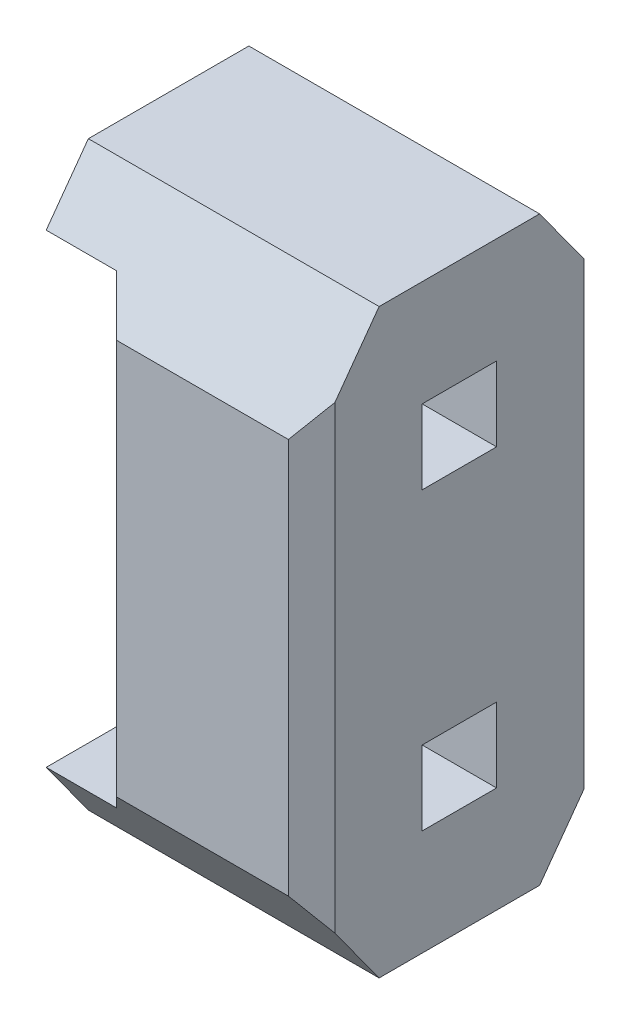
ISO-10303-21;
HEADER;
FILE_DESCRIPTION(('STEP AP214'),'2;1');
FILE_NAME('part.step','',(''),(''),'','','');
FILE_SCHEMA(('AUTOMOTIVE_DESIGN { 1 0 10303 214 1 1 1 1 }'));
ENDSEC;
DATA;
#1=APPLICATION_CONTEXT('core data for automotive mechanical design processes');
#2=APPLICATION_PROTOCOL_DEFINITION('international standard','automotive_design',2000,#1);
#3=PRODUCT_CONTEXT('',#1,'mechanical');
#4=PRODUCT('Part','Part','',(#3));
#5=PRODUCT_RELATED_PRODUCT_CATEGORY('part','',(#4));
#6=PRODUCT_DEFINITION_FORMATION('','',#4);
#7=PRODUCT_DEFINITION_CONTEXT('part definition',#1,'design');
#8=PRODUCT_DEFINITION('design','',#6,#7);
#9=PRODUCT_DEFINITION_SHAPE('','',#8);
#10=(LENGTH_UNIT() NAMED_UNIT(*) SI_UNIT(.MILLI.,.METRE.));
#11=(NAMED_UNIT(*) PLANE_ANGLE_UNIT() SI_UNIT($,.RADIAN.));
#12=(NAMED_UNIT(*) SI_UNIT($,.STERADIAN.) SOLID_ANGLE_UNIT());
#13=UNCERTAINTY_MEASURE_WITH_UNIT(LENGTH_MEASURE(1.E-05),#10,'distance_accuracy_value','');
#14=(GEOMETRIC_REPRESENTATION_CONTEXT(3) GLOBAL_UNCERTAINTY_ASSIGNED_CONTEXT((#13)) GLOBAL_UNIT_ASSIGNED_CONTEXT((#10,
#11,#12)) REPRESENTATION_CONTEXT('',''));
#15=CARTESIAN_POINT('',(0.,0.,0.));
#16=DIRECTION('',(0.,0.,1.));
#17=DIRECTION('',(1.,0.,0.));
#18=AXIS2_PLACEMENT_3D('',#15,#16,#17);
#19=CARTESIAN_POINT('',(1.25,4.6,-30.77));
#20=DIRECTION('',(0.,0.586967571460905,0.809610443394407));
#21=DIRECTION('',(0.,-0.809610443394407,0.586967571460905));
#22=AXIS2_PLACEMENT_3D('',#19,#20,#21);
#23=PLANE('',#22);
#24=DIRECTION('',(1.,0.,0.));
#25=VECTOR('',#24,1.);
#26=CARTESIAN_POINT('',(1.25,4.5,-30.6975));
#27=LINE('',#26,#25);
#28=CARTESIAN_POINT('',(0.,4.5,-30.6975));
#29=VERTEX_POINT('',#28);
#30=CARTESIAN_POINT('',(0.602500000000325,4.5,-30.6975000000001));
#31=VERTEX_POINT('',#30);
#32=EDGE_CURVE('E199',#29,#31,#27,.T.);
#33=ORIENTED_EDGE('',*,*,#32,.T.);
#34=DIRECTION('',(0.506207656348697,-0.698217457033984,0.506207656349602));
#35=VECTOR('',#34,1.);
#36=CARTESIAN_POINT('',(0.6025000000002,4.5,-30.6975));
#37=LINE('',#36,#35);
#38=CARTESIAN_POINT('',(0.819999999999671,4.2,-30.4799999999999));
#39=VERTEX_POINT('',#38);
#40=EDGE_CURVE('E197',#31,#39,#37,.T.);
#41=ORIENTED_EDGE('',*,*,#40,.T.);
#42=DIRECTION('',(1.,0.,0.));
#43=VECTOR('',#42,1.);
#44=CARTESIAN_POINT('',(1.25,4.19999999999999,-30.48));
#45=LINE('',#44,#43);
#46=CARTESIAN_POINT('',(2.30000000000012,4.2,-30.4799999999999));
#47=VERTEX_POINT('',#46);
#48=EDGE_CURVE('E20',#39,#47,#45,.T.);
#49=ORIENTED_EDGE('',*,*,#48,.T.);
#50=DIRECTION('',(0.506207656348961,0.698217457033859,-0.50620765634951));
#51=VECTOR('',#50,1.);
#52=CARTESIAN_POINT('',(2.3,4.19999999999999,-30.48));
#53=LINE('',#52,#51);
#54=CARTESIAN_POINT('',(2.49999999999988,4.47586206896591,-30.6800000000002));
#55=VERTEX_POINT('',#54);
#56=EDGE_CURVE('E181',#47,#55,#53,.T.);
#57=ORIENTED_EDGE('',*,*,#56,.T.);
#58=DIRECTION('',(0.,-0.809610443394407,0.586967571460905));
#59=VECTOR('',#58,1.);
#60=CARTESIAN_POINT('',(2.5,4.6,-30.77));
#61=LINE('',#60,#59);
#62=CARTESIAN_POINT('',(2.5,5.00000000000001,-31.06));
#63=VERTEX_POINT('',#62);
#64=EDGE_CURVE('E188',#55,#63,#61,.F.);
#65=ORIENTED_EDGE('',*,*,#64,.T.);
#66=DIRECTION('',(1.,0.,0.));
#67=VECTOR('',#66,1.);
#68=CARTESIAN_POINT('',(1.25,5.,-31.06));
#69=LINE('',#68,#67);
#70=CARTESIAN_POINT('',(0.,5.00000000000001,-31.06));
#71=VERTEX_POINT('',#70);
#72=EDGE_CURVE('E215',#71,#63,#69,.T.);
#73=ORIENTED_EDGE('',*,*,#72,.F.);
#74=DIRECTION('',(0.,-0.809610443394407,0.586967571460905));
#75=VECTOR('',#74,1.);
#76=CARTESIAN_POINT('',(0.,4.6,-30.77));
#77=LINE('',#76,#75);
#78=EDGE_CURVE('E207',#71,#29,#77,.T.);
#79=ORIENTED_EDGE('',*,*,#78,.T.);
#80=EDGE_LOOP('',(#33,#41,#49,#57,#65,#73,#79));
#81=FACE_BOUND('',#80,.T.);
#82=ADVANCED_FACE('F17',(#81),#23,.T.);
#83=CARTESIAN_POINT('',(1.25,4.6,-32.73));
#84=DIRECTION('',(0.,-0.586967571460905,0.809610443394407));
#85=DIRECTION('',(0.,-0.809610443394407,-0.586967571460905));
#86=AXIS2_PLACEMENT_3D('',#83,#84,#85);
#87=PLANE('',#86);
#88=DIRECTION('',(0.,-0.809610443394407,-0.586967571460905));
#89=VECTOR('',#88,1.);
#90=CARTESIAN_POINT('',(0.,4.6,-32.73));
#91=LINE('',#90,#89);
#92=CARTESIAN_POINT('',(0.,5.,-32.44));
#93=VERTEX_POINT('',#92);
#94=CARTESIAN_POINT('',(0.,4.5,-32.8025));
#95=VERTEX_POINT('',#94);
#96=EDGE_CURVE('E263',#93,#95,#91,.T.);
#97=ORIENTED_EDGE('',*,*,#96,.F.);
#98=DIRECTION('',(1.,0.,0.));
#99=VECTOR('',#98,1.);
#100=CARTESIAN_POINT('',(1.25,5.,-32.44));
#101=LINE('',#100,#99);
#102=CARTESIAN_POINT('',(2.5,5.,-32.44));
#103=VERTEX_POINT('',#102);
#104=EDGE_CURVE('E227',#103,#93,#101,.F.);
#105=ORIENTED_EDGE('',*,*,#104,.F.);
#106=DIRECTION('',(0.,-0.809610443394407,-0.586967571460905));
#107=VECTOR('',#106,1.);
#108=CARTESIAN_POINT('',(2.5,4.6,-32.73));
#109=LINE('',#108,#107);
#110=CARTESIAN_POINT('',(2.49999999999988,4.47586206896591,-32.8199999999998));
#111=VERTEX_POINT('',#110);
#112=EDGE_CURVE('E223',#111,#103,#109,.F.);
#113=ORIENTED_EDGE('',*,*,#112,.F.);
#114=DIRECTION('',(0.506207656348956,0.698217457033859,0.506207656349515));
#115=VECTOR('',#114,1.);
#116=CARTESIAN_POINT('',(2.3,4.19999999999999,-33.02));
#117=LINE('',#116,#115);
#118=CARTESIAN_POINT('',(2.30000000000012,4.19999999999999,-33.0200000000001));
#119=VERTEX_POINT('',#118);
#120=EDGE_CURVE('E266',#119,#111,#117,.T.);
#121=ORIENTED_EDGE('',*,*,#120,.F.);
#122=DIRECTION('',(1.,0.,0.));
#123=VECTOR('',#122,1.);
#124=CARTESIAN_POINT('',(1.25,4.19999999999999,-33.02));
#125=LINE('',#124,#123);
#126=CARTESIAN_POINT('',(0.819999999999672,4.19999999999999,-33.0200000000001));
#127=VERTEX_POINT('',#126);
#128=EDGE_CURVE('E205',#127,#119,#125,.T.);
#129=ORIENTED_EDGE('',*,*,#128,.F.);
#130=DIRECTION('',(0.506207656348698,-0.698217457033983,-0.506207656349602));
#131=VECTOR('',#130,1.);
#132=CARTESIAN_POINT('',(0.6025000000002,4.49999999999999,-32.8025));
#133=LINE('',#132,#131);
#134=CARTESIAN_POINT('',(0.602500000000326,4.5,-32.8024999999999));
#135=VERTEX_POINT('',#134);
#136=EDGE_CURVE('E203',#135,#127,#133,.T.);
#137=ORIENTED_EDGE('',*,*,#136,.F.);
#138=DIRECTION('',(1.,0.,0.));
#139=VECTOR('',#138,1.);
#140=CARTESIAN_POINT('',(1.25,4.49999999999999,-32.8025));
#141=LINE('',#140,#139);
#142=EDGE_CURVE('E261',#95,#135,#141,.T.);
#143=ORIENTED_EDGE('',*,*,#142,.F.);
#144=EDGE_LOOP('',(#97,#105,#113,#121,#129,#137,#143));
#145=FACE_BOUND('',#144,.T.);
#146=ADVANCED_FACE('F285',(#145),#87,.F.);
#147=CARTESIAN_POINT('',(1.25,0.4,-32.73));
#148=DIRECTION('',(0.,0.586967571460905,0.809610443394407));
#149=DIRECTION('',(0.,-0.809610443394407,0.586967571460905));
#150=AXIS2_PLACEMENT_3D('',#147,#148,#149);
#151=PLANE('',#150);
#152=DIRECTION('',(-0.506207656349401,0.698217457033646,-0.506207656349363));
#153=VECTOR('',#152,1.);
#154=CARTESIAN_POINT('',(2.5,0.5241379310345,-32.82));
#155=LINE('',#154,#153);
#156=CARTESIAN_POINT('',(2.49999999999988,0.5241379310345,-32.8199999999999));
#157=VERTEX_POINT('',#156);
#158=CARTESIAN_POINT('',(2.30000000000012,0.800000000000007,-33.0200000000001));
#159=VERTEX_POINT('',#158);
#160=EDGE_CURVE('E251',#157,#159,#155,.T.);
#161=ORIENTED_EDGE('',*,*,#160,.F.);
#162=DIRECTION('',(0.,-0.809610443394407,0.586967571460905));
#163=VECTOR('',#162,1.);
#164=CARTESIAN_POINT('',(2.5,0.4,-32.73));
#165=LINE('',#164,#163);
#166=CARTESIAN_POINT('',(2.5,0.,-32.44));
#167=VERTEX_POINT('',#166);
#168=EDGE_CURVE('E253',#167,#157,#165,.F.);
#169=ORIENTED_EDGE('',*,*,#168,.F.);
#170=DIRECTION('',(1.,0.,0.));
#171=VECTOR('',#170,1.);
#172=CARTESIAN_POINT('',(1.25,0.,-32.44));
#173=LINE('',#172,#171);
#174=CARTESIAN_POINT('',(0.,0.,-32.44));
#175=VERTEX_POINT('',#174);
#176=EDGE_CURVE('E288',#167,#175,#173,.F.);
#177=ORIENTED_EDGE('',*,*,#176,.T.);
#178=DIRECTION('',(0.,-0.809610443394407,0.586967571460905));
#179=VECTOR('',#178,1.);
#180=CARTESIAN_POINT('',(0.,0.4,-32.73));
#181=LINE('',#180,#179);
#182=CARTESIAN_POINT('',(0.,0.500000000000005,-32.8025));
#183=VERTEX_POINT('',#182);
#184=EDGE_CURVE('E255',#183,#175,#181,.T.);
#185=ORIENTED_EDGE('',*,*,#184,.F.);
#186=DIRECTION('',(1.,0.,0.));
#187=VECTOR('',#186,1.);
#188=CARTESIAN_POINT('',(1.25,0.500000000000009,-32.8025));
#189=LINE('',#188,#187);
#190=CARTESIAN_POINT('',(0.602500000000326,0.500000000000004,-32.8024999999999));
#191=VERTEX_POINT('',#190);
#192=EDGE_CURVE('E257',#191,#183,#189,.F.);
#193=ORIENTED_EDGE('',*,*,#192,.F.);
#194=DIRECTION('',(-0.506207656348698,-0.698217457033982,0.506207656349602));
#195=VECTOR('',#194,1.);
#196=CARTESIAN_POINT('',(0.8199999999998,0.800000000000013,-33.02));
#197=LINE('',#196,#195);
#198=CARTESIAN_POINT('',(0.819999999999672,0.800000000000007,-33.0200000000001));
#199=VERTEX_POINT('',#198);
#200=EDGE_CURVE('E259',#199,#191,#197,.T.);
#201=ORIENTED_EDGE('',*,*,#200,.F.);
#202=DIRECTION('',(1.,0.,0.));
#203=VECTOR('',#202,1.);
#204=CARTESIAN_POINT('',(1.25,0.800000000000013,-33.02));
#205=LINE('',#204,#203);
#206=EDGE_CURVE('E249',#159,#199,#205,.F.);
#207=ORIENTED_EDGE('',*,*,#206,.F.);
#208=EDGE_LOOP('',(#161,#169,#177,#185,#193,#201,#207));
#209=FACE_BOUND('',#208,.T.);
#210=ADVANCED_FACE('F431',(#209),#151,.F.);
#211=CARTESIAN_POINT('',(1.25,0.4,-30.77));
#212=DIRECTION('',(0.,-0.586967571460905,0.809610443394407));
#213=DIRECTION('',(0.,-0.809610443394407,-0.586967571460905));
#214=AXIS2_PLACEMENT_3D('',#211,#212,#213);
#215=PLANE('',#214);
#216=DIRECTION('',(1.,0.,0.));
#217=VECTOR('',#216,1.);
#218=CARTESIAN_POINT('',(1.25,0.80000000000001,-30.48));
#219=LINE('',#218,#217);
#220=CARTESIAN_POINT('',(2.30000000000012,0.800000000000005,-30.4799999999999));
#221=VERTEX_POINT('',#220);
#222=CARTESIAN_POINT('',(0.819999999999671,0.800000000000005,-30.4799999999999));
#223=VERTEX_POINT('',#222);
#224=EDGE_CURVE('E191',#221,#223,#219,.F.);
#225=ORIENTED_EDGE('',*,*,#224,.T.);
#226=DIRECTION('',(-0.506207656348693,-0.698217457033984,-0.506207656349605));
#227=VECTOR('',#226,1.);
#228=CARTESIAN_POINT('',(0.8199999999998,0.80000000000001,-30.48));
#229=LINE('',#228,#227);
#230=CARTESIAN_POINT('',(0.602500000000324,0.5,-30.6975000000001));
#231=VERTEX_POINT('',#230);
#232=EDGE_CURVE('E232',#223,#231,#229,.T.);
#233=ORIENTED_EDGE('',*,*,#232,.T.);
#234=DIRECTION('',(1.,0.,0.));
#235=VECTOR('',#234,1.);
#236=CARTESIAN_POINT('',(1.25,0.500000000000001,-30.6975));
#237=LINE('',#236,#235);
#238=CARTESIAN_POINT('',(0.,0.5,-30.6975));
#239=VERTEX_POINT('',#238);
#240=EDGE_CURVE('E246',#231,#239,#237,.F.);
#241=ORIENTED_EDGE('',*,*,#240,.T.);
#242=DIRECTION('',(0.,-0.809610443394407,-0.586967571460905));
#243=VECTOR('',#242,1.);
#244=CARTESIAN_POINT('',(0.,0.4,-30.77));
#245=LINE('',#244,#243);
#246=CARTESIAN_POINT('',(0.,0.,-31.06));
#247=VERTEX_POINT('',#246);
#248=EDGE_CURVE('E244',#239,#247,#245,.T.);
#249=ORIENTED_EDGE('',*,*,#248,.T.);
#250=DIRECTION('',(1.,0.,0.));
#251=VECTOR('',#250,1.);
#252=CARTESIAN_POINT('',(1.25,0.,-31.06));
#253=LINE('',#252,#251);
#254=CARTESIAN_POINT('',(2.5,0.,-31.06));
#255=VERTEX_POINT('',#254);
#256=EDGE_CURVE('E293',#247,#255,#253,.T.);
#257=ORIENTED_EDGE('',*,*,#256,.T.);
#258=DIRECTION('',(0.,-0.809610443394407,-0.586967571460905));
#259=VECTOR('',#258,1.);
#260=CARTESIAN_POINT('',(2.5,0.4,-30.77));
#261=LINE('',#260,#259);
#262=CARTESIAN_POINT('',(2.49999999999988,0.524137931034498,-30.6800000000001));
#263=VERTEX_POINT('',#262);
#264=EDGE_CURVE('E241',#255,#263,#261,.F.);
#265=ORIENTED_EDGE('',*,*,#264,.T.);
#266=DIRECTION('',(-0.506207656349401,0.698217457033646,0.506207656349363));
#267=VECTOR('',#266,1.);
#268=CARTESIAN_POINT('',(2.5,0.524137931034496,-30.68));
#269=LINE('',#268,#267);
#270=EDGE_CURVE('E239',#263,#221,#269,.T.);
#271=ORIENTED_EDGE('',*,*,#270,.T.);
#272=EDGE_LOOP('',(#225,#233,#241,#249,#257,#265,#271));
#273=FACE_BOUND('',#272,.T.);
#274=ADVANCED_FACE('F421',(#273),#215,.T.);
#275=CARTESIAN_POINT('',(1.25,5.,-31.75));
#276=DIRECTION('',(0.,1.,0.));
#277=DIRECTION('',(0.,0.,1.));
#278=AXIS2_PLACEMENT_3D('',#275,#276,#277);
#279=PLANE('',#278);
#280=ORIENTED_EDGE('',*,*,#104,.T.);
#281=DIRECTION('',(0.,0.,-1.));
#282=VECTOR('',#281,1.);
#283=CARTESIAN_POINT('',(0.,5.,-31.75));
#284=LINE('',#283,#282);
#285=EDGE_CURVE('E231',#93,#71,#284,.F.);
#286=ORIENTED_EDGE('',*,*,#285,.T.);
#287=ORIENTED_EDGE('',*,*,#72,.T.);
#288=DIRECTION('',(0.,0.,1.));
#289=VECTOR('',#288,1.);
#290=CARTESIAN_POINT('',(2.5,5.,-31.75));
#291=LINE('',#290,#289);
#292=EDGE_CURVE('E219',#63,#103,#291,.F.);
#293=ORIENTED_EDGE('',*,*,#292,.T.);
#294=EDGE_LOOP('',(#280,#286,#287,#293));
#295=FACE_BOUND('',#294,.T.);
#296=ADVANCED_FACE('F229',(#295),#279,.T.);
#297=CARTESIAN_POINT('',(1.25,0.,-31.75));
#298=DIRECTION('',(0.,1.,0.));
#299=DIRECTION('',(0.,0.,1.));
#300=AXIS2_PLACEMENT_3D('',#297,#298,#299);
#301=PLANE('',#300);
#302=DIRECTION('',(0.,0.,-1.));
#303=VECTOR('',#302,1.);
#304=CARTESIAN_POINT('',(0.,0.,-31.75));
#305=LINE('',#304,#303);
#306=EDGE_CURVE('E297',#247,#175,#305,.T.);
#307=ORIENTED_EDGE('',*,*,#306,.T.);
#308=ORIENTED_EDGE('',*,*,#176,.F.);
#309=DIRECTION('',(0.,0.,1.));
#310=VECTOR('',#309,1.);
#311=CARTESIAN_POINT('',(2.5,0.,-31.75));
#312=LINE('',#311,#310);
#313=EDGE_CURVE('E287',#255,#167,#312,.F.);
#314=ORIENTED_EDGE('',*,*,#313,.F.);
#315=ORIENTED_EDGE('',*,*,#256,.F.);
#316=EDGE_LOOP('',(#307,#308,#314,#315));
#317=FACE_BOUND('',#316,.T.);
#318=ADVANCED_FACE('F428',(#317),#301,.F.);
#319=CARTESIAN_POINT('',(0.,4.75,-31.75));
#320=DIRECTION('',(1.,0.,0.));
#321=DIRECTION('',(0.,0.,-1.));
#322=AXIS2_PLACEMENT_3D('',#319,#320,#321);
#323=PLANE('',#322);
#324=ORIENTED_EDGE('',*,*,#285,.F.);
#325=ORIENTED_EDGE('',*,*,#96,.T.);
#326=DIRECTION('',(0.,0.,1.));
#327=VECTOR('',#326,1.);
#328=CARTESIAN_POINT('',(0.,4.5,-31.75));
#329=LINE('',#328,#327);
#330=EDGE_CURVE('E307',#95,#29,#329,.T.);
#331=ORIENTED_EDGE('',*,*,#330,.T.);
#332=ORIENTED_EDGE('',*,*,#78,.F.);
#333=EDGE_LOOP('',(#324,#325,#331,#332));
#334=FACE_BOUND('',#333,.T.);
#335=ADVANCED_FACE('F441',(#334),#323,.F.);
#336=CARTESIAN_POINT('',(0.,0.25,-31.75));
#337=DIRECTION('',(1.,0.,0.));
#338=DIRECTION('',(0.,0.,-1.));
#339=AXIS2_PLACEMENT_3D('',#336,#337,#338);
#340=PLANE('',#339);
#341=ORIENTED_EDGE('',*,*,#306,.F.);
#342=ORIENTED_EDGE('',*,*,#248,.F.);
#343=DIRECTION('',(0.,0.,1.));
#344=VECTOR('',#343,1.);
#345=CARTESIAN_POINT('',(0.,0.5,-31.75));
#346=LINE('',#345,#344);
#347=EDGE_CURVE('E315',#183,#239,#346,.T.);
#348=ORIENTED_EDGE('',*,*,#347,.F.);
#349=ORIENTED_EDGE('',*,*,#184,.T.);
#350=EDGE_LOOP('',(#341,#342,#348,#349));
#351=FACE_BOUND('',#350,.T.);
#352=ADVANCED_FACE('F443',(#351),#340,.F.);
#353=CARTESIAN_POINT('',(1.55,3.45,-31.75));
#354=DIRECTION('',(0.,1.,0.));
#355=DIRECTION('',(0.,0.,1.));
#356=AXIS2_PLACEMENT_3D('',#353,#354,#355);
#357=PLANE('',#356);
#358=DIRECTION('',(1.,0.,0.));
#359=VECTOR('',#358,1.);
#360=CARTESIAN_POINT('',(1.55,3.45,-32.07));
#361=LINE('',#360,#359);
#362=CARTESIAN_POINT('',(0.6,3.45,-32.07));
#363=VERTEX_POINT('',#362);
#364=CARTESIAN_POINT('',(2.5,3.45,-32.07));
#365=VERTEX_POINT('',#364);
#366=EDGE_CURVE('E332',#363,#365,#361,.T.);
#367=ORIENTED_EDGE('',*,*,#366,.F.);
#368=DIRECTION('',(0.,0.,1.));
#369=VECTOR('',#368,1.);
#370=CARTESIAN_POINT('',(0.6,3.45,-31.75));
#371=LINE('',#370,#369);
#372=CARTESIAN_POINT('',(0.6,3.45,-31.43));
#373=VERTEX_POINT('',#372);
#374=EDGE_CURVE('E302',#363,#373,#371,.T.);
#375=ORIENTED_EDGE('',*,*,#374,.T.);
#376=DIRECTION('',(1.,0.,0.));
#377=VECTOR('',#376,1.);
#378=CARTESIAN_POINT('',(1.55,3.45,-31.43));
#379=LINE('',#378,#377);
#380=CARTESIAN_POINT('',(2.5,3.45,-31.43));
#381=VERTEX_POINT('',#380);
#382=EDGE_CURVE('E327',#373,#381,#379,.T.);
#383=ORIENTED_EDGE('',*,*,#382,.T.);
#384=DIRECTION('',(0.,0.,1.));
#385=VECTOR('',#384,1.);
#386=CARTESIAN_POINT('',(2.5,3.45,-31.75));
#387=LINE('',#386,#385);
#388=EDGE_CURVE('E300',#381,#365,#387,.F.);
#389=ORIENTED_EDGE('',*,*,#388,.T.);
#390=EDGE_LOOP('',(#367,#375,#383,#389));
#391=FACE_BOUND('',#390,.T.);
#392=ADVANCED_FACE('F398',(#391),#357,.T.);
#393=CARTESIAN_POINT('',(0.71,2.5,-32.91));
#394=DIRECTION('',(0.707106781190498,0.,0.707106781182598));
#395=DIRECTION('',(0.707106781182598,0.,-0.707106781190498));
#396=AXIS2_PLACEMENT_3D('',#393,#394,#395);
#397=PLANE('',#396);
#398=ORIENTED_EDGE('',*,*,#200,.T.);
#399=DIRECTION('',(0.707106781185198,0.,-0.707106781187897));
#400=VECTOR('',#399,1.);
#401=CARTESIAN_POINT('',(0.6000000000002,0.5,-32.8));
#402=LINE('',#401,#400);
#403=CARTESIAN_POINT('',(0.600000000000408,0.5,-32.7999999999997));
#404=VERTEX_POINT('',#403);
#405=EDGE_CURVE('E312',#404,#191,#402,.T.);
#406=ORIENTED_EDGE('',*,*,#405,.F.);
#407=DIRECTION('',(0.,1.,0.));
#408=VECTOR('',#407,1.);
#409=CARTESIAN_POINT('',(0.6,2.5,-32.8));
#410=LINE('',#409,#408);
#411=CARTESIAN_POINT('',(0.600000000000408,4.5,-32.7999999999997));
#412=VERTEX_POINT('',#411);
#413=EDGE_CURVE('E337',#404,#412,#410,.T.);
#414=ORIENTED_EDGE('',*,*,#413,.T.);
#415=DIRECTION('',(0.707106781185198,0.,-0.707106781187897));
#416=VECTOR('',#415,1.);
#417=CARTESIAN_POINT('',(0.6000000000002,4.5,-32.8));
#418=LINE('',#417,#416);
#419=EDGE_CURVE('E304',#412,#135,#418,.T.);
#420=ORIENTED_EDGE('',*,*,#419,.T.);
#421=ORIENTED_EDGE('',*,*,#136,.T.);
#422=DIRECTION('',(0.,1.,0.));
#423=VECTOR('',#422,1.);
#424=CARTESIAN_POINT('',(0.8199999999998,2.5,-33.02));
#425=LINE('',#424,#423);
#426=EDGE_CURVE('E275',#127,#199,#425,.F.);
#427=ORIENTED_EDGE('',*,*,#426,.T.);
#428=EDGE_LOOP('',(#398,#406,#414,#420,#421,#427));
#429=FACE_BOUND('',#428,.T.);
#430=ADVANCED_FACE('F435',(#429),#397,.F.);
#431=CARTESIAN_POINT('',(0.30125,4.5,-31.75));
#432=DIRECTION('',(0.,1.,0.));
#433=DIRECTION('',(0.,0.,1.));
#434=AXIS2_PLACEMENT_3D('',#431,#432,#433);
#435=PLANE('',#434);
#436=ORIENTED_EDGE('',*,*,#142,.T.);
#437=ORIENTED_EDGE('',*,*,#419,.F.);
#438=DIRECTION('',(0.,0.,-1.));
#439=VECTOR('',#438,1.);
#440=CARTESIAN_POINT('',(0.6,4.5,-31.75));
#441=LINE('',#440,#439);
#442=CARTESIAN_POINT('',(0.600000000000278,4.5,-30.7000000000001));
#443=VERTEX_POINT('',#442);
#444=EDGE_CURVE('E339',#412,#443,#441,.F.);
#445=ORIENTED_EDGE('',*,*,#444,.T.);
#446=DIRECTION('',(-0.707106781182598,0.,-0.707106781190498));
#447=VECTOR('',#446,1.);
#448=CARTESIAN_POINT('',(0.71,4.5,-30.59));
#449=LINE('',#448,#447);
#450=EDGE_CURVE('E310',#443,#31,#449,.F.);
#451=ORIENTED_EDGE('',*,*,#450,.T.);
#452=ORIENTED_EDGE('',*,*,#32,.F.);
#453=ORIENTED_EDGE('',*,*,#330,.F.);
#454=EDGE_LOOP('',(#436,#437,#445,#451,#452,#453));
#455=FACE_BOUND('',#454,.T.);
#456=ADVANCED_FACE('F439',(#455),#435,.F.);
#457=CARTESIAN_POINT('',(0.71,2.5,-30.59));
#458=DIRECTION('',(0.707106781190498,0.,-0.707106781182598));
#459=DIRECTION('',(-0.707106781182598,0.,-0.707106781190498));
#460=AXIS2_PLACEMENT_3D('',#457,#458,#459);
#461=PLANE('',#460);
#462=ORIENTED_EDGE('',*,*,#232,.F.);
#463=DIRECTION('',(0.,1.,0.));
#464=VECTOR('',#463,1.);
#465=CARTESIAN_POINT('',(0.8199999999998,2.5,-30.48));
#466=LINE('',#465,#464);
#467=EDGE_CURVE('E325',#39,#223,#466,.F.);
#468=ORIENTED_EDGE('',*,*,#467,.F.);
#469=ORIENTED_EDGE('',*,*,#40,.F.);
#470=ORIENTED_EDGE('',*,*,#450,.F.);
#471=DIRECTION('',(0.,1.,0.));
#472=VECTOR('',#471,1.);
#473=CARTESIAN_POINT('',(0.6,2.5,-30.7));
#474=LINE('',#473,#472);
#475=CARTESIAN_POINT('',(0.600000000000407,0.5,-30.7000000000003));
#476=VERTEX_POINT('',#475);
#477=EDGE_CURVE('E341',#443,#476,#474,.F.);
#478=ORIENTED_EDGE('',*,*,#477,.T.);
#479=DIRECTION('',(-0.70710678118667,0.,-0.707106781186425));
#480=VECTOR('',#479,1.);
#481=CARTESIAN_POINT('',(0.6025000000002,0.5,-30.6975));
#482=LINE('',#481,#480);
#483=EDGE_CURVE('E318',#231,#476,#482,.T.);
#484=ORIENTED_EDGE('',*,*,#483,.F.);
#485=EDGE_LOOP('',(#462,#468,#469,#470,#478,#484));
#486=FACE_BOUND('',#485,.T.);
#487=ADVANCED_FACE('F416',(#486),#461,.F.);
#488=CARTESIAN_POINT('',(0.30125,0.5,-31.75));
#489=DIRECTION('',(0.,1.,0.));
#490=DIRECTION('',(0.,0.,1.));
#491=AXIS2_PLACEMENT_3D('',#488,#489,#490);
#492=PLANE('',#491);
#493=ORIENTED_EDGE('',*,*,#483,.T.);
#494=DIRECTION('',(0.,0.,-1.));
#495=VECTOR('',#494,1.);
#496=CARTESIAN_POINT('',(0.6,0.5,-31.75));
#497=LINE('',#496,#495);
#498=EDGE_CURVE('E343',#476,#404,#497,.T.);
#499=ORIENTED_EDGE('',*,*,#498,.T.);
#500=ORIENTED_EDGE('',*,*,#405,.T.);
#501=ORIENTED_EDGE('',*,*,#192,.T.);
#502=ORIENTED_EDGE('',*,*,#347,.T.);
#503=ORIENTED_EDGE('',*,*,#240,.F.);
#504=EDGE_LOOP('',(#493,#499,#500,#501,#502,#503));
#505=FACE_BOUND('',#504,.T.);
#506=ADVANCED_FACE('F418',(#505),#492,.T.);
#507=CARTESIAN_POINT('',(1.55,1.23,-32.07));
#508=DIRECTION('',(0.,0.,1.));
#509=DIRECTION('',(1.,0.,0.));
#510=AXIS2_PLACEMENT_3D('',#507,#508,#509);
#511=PLANE('',#510);
#512=DIRECTION('',(1.,0.,0.));
#513=VECTOR('',#512,1.);
#514=CARTESIAN_POINT('',(1.55,1.55,-32.07));
#515=LINE('',#514,#513);
#516=CARTESIAN_POINT('',(2.5,1.55,-32.07));
#517=VERTEX_POINT('',#516);
#518=CARTESIAN_POINT('',(0.6,1.55,-32.07));
#519=VERTEX_POINT('',#518);
#520=EDGE_CURVE('E283',#517,#519,#515,.F.);
#521=ORIENTED_EDGE('',*,*,#520,.T.);
#522=DIRECTION('',(0.,1.,0.));
#523=VECTOR('',#522,1.);
#524=CARTESIAN_POINT('',(0.6,2.5,-32.07));
#525=LINE('',#524,#523);
#526=CARTESIAN_POINT('',(0.6,0.91,-32.07));
#527=VERTEX_POINT('',#526);
#528=EDGE_CURVE('E346',#519,#527,#525,.F.);
#529=ORIENTED_EDGE('',*,*,#528,.T.);
#530=DIRECTION('',(1.,0.,0.));
#531=VECTOR('',#530,1.);
#532=CARTESIAN_POINT('',(1.55,0.91,-32.07));
#533=LINE('',#532,#531);
#534=CARTESIAN_POINT('',(2.5,0.91,-32.07));
#535=VERTEX_POINT('',#534);
#536=EDGE_CURVE('E354',#535,#527,#533,.F.);
#537=ORIENTED_EDGE('',*,*,#536,.F.);
#538=DIRECTION('',(0.,1.,0.));
#539=VECTOR('',#538,1.);
#540=CARTESIAN_POINT('',(2.5,1.23,-32.07));
#541=LINE('',#540,#539);
#542=EDGE_CURVE('E321',#535,#517,#541,.T.);
#543=ORIENTED_EDGE('',*,*,#542,.T.);
#544=EDGE_LOOP('',(#521,#529,#537,#543));
#545=FACE_BOUND('',#544,.T.);
#546=ADVANCED_FACE('F483',(#545),#511,.T.);
#547=CARTESIAN_POINT('',(1.56,2.5,-33.02));
#548=DIRECTION('',(0.,0.,1.));
#549=DIRECTION('',(1.,0.,0.));
#550=AXIS2_PLACEMENT_3D('',#547,#548,#549);
#551=PLANE('',#550);
#552=DIRECTION('',(0.,1.,0.));
#553=VECTOR('',#552,1.);
#554=CARTESIAN_POINT('',(2.30000000000047,2.5,-33.0200000000005));
#555=LINE('',#554,#553);
#556=EDGE_CURVE('E193',#159,#119,#555,.T.);
#557=ORIENTED_EDGE('',*,*,#556,.F.);
#558=ORIENTED_EDGE('',*,*,#206,.T.);
#559=ORIENTED_EDGE('',*,*,#426,.F.);
#560=ORIENTED_EDGE('',*,*,#128,.T.);
#561=EDGE_LOOP('',(#557,#558,#559,#560));
#562=FACE_BOUND('',#561,.T.);
#563=ADVANCED_FACE('F272',(#562),#551,.F.);
#564=CARTESIAN_POINT('',(1.56,2.5,-30.48));
#565=DIRECTION('',(0.,0.,1.));
#566=DIRECTION('',(1.,0.,0.));
#567=AXIS2_PLACEMENT_3D('',#564,#565,#566);
#568=PLANE('',#567);
#569=ORIENTED_EDGE('',*,*,#48,.F.);
#570=ORIENTED_EDGE('',*,*,#467,.T.);
#571=ORIENTED_EDGE('',*,*,#224,.F.);
#572=DIRECTION('',(0.,1.,0.));
#573=VECTOR('',#572,1.);
#574=CARTESIAN_POINT('',(2.30000000000047,2.5,-30.4799999999995));
#575=LINE('',#574,#573);
#576=EDGE_CURVE('E183',#47,#221,#575,.F.);
#577=ORIENTED_EDGE('',*,*,#576,.F.);
#578=EDGE_LOOP('',(#569,#570,#571,#577));
#579=FACE_BOUND('',#578,.T.);
#580=ADVANCED_FACE('F189',(#579),#568,.T.);
#581=CARTESIAN_POINT('',(1.55,3.77,-31.43));
#582=DIRECTION('',(0.,0.,1.));
#583=DIRECTION('',(1.,0.,0.));
#584=AXIS2_PLACEMENT_3D('',#581,#582,#583);
#585=PLANE('',#584);
#586=DIRECTION('',(0.,1.,0.));
#587=VECTOR('',#586,1.);
#588=CARTESIAN_POINT('',(2.5,3.77,-31.43));
#589=LINE('',#588,#587);
#590=CARTESIAN_POINT('',(2.5,4.09,-31.43));
#591=VERTEX_POINT('',#590);
#592=EDGE_CURVE('E330',#381,#591,#589,.T.);
#593=ORIENTED_EDGE('',*,*,#592,.F.);
#594=ORIENTED_EDGE('',*,*,#382,.F.);
#595=DIRECTION('',(0.,1.,0.));
#596=VECTOR('',#595,1.);
#597=CARTESIAN_POINT('',(0.6,2.5,-31.43));
#598=LINE('',#597,#596);
#599=CARTESIAN_POINT('',(0.6,4.09,-31.43));
#600=VERTEX_POINT('',#599);
#601=EDGE_CURVE('E351',#373,#600,#598,.T.);
#602=ORIENTED_EDGE('',*,*,#601,.T.);
#603=DIRECTION('',(1.,0.,0.));
#604=VECTOR('',#603,1.);
#605=CARTESIAN_POINT('',(1.55,4.09,-31.43));
#606=LINE('',#605,#604);
#607=EDGE_CURVE('E368',#600,#591,#606,.T.);
#608=ORIENTED_EDGE('',*,*,#607,.T.);
#609=EDGE_LOOP('',(#593,#594,#602,#608));
#610=FACE_BOUND('',#609,.T.);
#611=ADVANCED_FACE('F402',(#610),#585,.F.);
#612=CARTESIAN_POINT('',(1.55,3.77,-32.07));
#613=DIRECTION('',(0.,0.,1.));
#614=DIRECTION('',(1.,0.,0.));
#615=AXIS2_PLACEMENT_3D('',#612,#613,#614);
#616=PLANE('',#615);
#617=DIRECTION('',(1.,0.,0.));
#618=VECTOR('',#617,1.);
#619=CARTESIAN_POINT('',(1.55,4.09,-32.07));
#620=LINE('',#619,#618);
#621=CARTESIAN_POINT('',(2.5,4.09,-32.07));
#622=VERTEX_POINT('',#621);
#623=CARTESIAN_POINT('',(0.6,4.09,-32.07));
#624=VERTEX_POINT('',#623);
#625=EDGE_CURVE('E371',#622,#624,#620,.F.);
#626=ORIENTED_EDGE('',*,*,#625,.T.);
#627=DIRECTION('',(0.,1.,0.));
#628=VECTOR('',#627,1.);
#629=CARTESIAN_POINT('',(0.6,2.5,-32.07));
#630=LINE('',#629,#628);
#631=EDGE_CURVE('E348',#624,#363,#630,.F.);
#632=ORIENTED_EDGE('',*,*,#631,.T.);
#633=ORIENTED_EDGE('',*,*,#366,.T.);
#634=DIRECTION('',(0.,1.,0.));
#635=VECTOR('',#634,1.);
#636=CARTESIAN_POINT('',(2.5,3.77,-32.07));
#637=LINE('',#636,#635);
#638=EDGE_CURVE('E335',#365,#622,#637,.T.);
#639=ORIENTED_EDGE('',*,*,#638,.T.);
#640=EDGE_LOOP('',(#626,#632,#633,#639));
#641=FACE_BOUND('',#640,.T.);
#642=ADVANCED_FACE('F395',(#641),#616,.T.);
#643=CARTESIAN_POINT('',(0.6,2.5,-31.75));
#644=DIRECTION('',(1.,0.,0.));
#645=DIRECTION('',(0.,0.,-1.));
#646=AXIS2_PLACEMENT_3D('',#643,#644,#645);
#647=PLANE('',#646);
#648=ORIENTED_EDGE('',*,*,#374,.F.);
#649=ORIENTED_EDGE('',*,*,#631,.F.);
#650=DIRECTION('',(0.,0.,1.));
#651=VECTOR('',#650,1.);
#652=CARTESIAN_POINT('',(0.6,4.09,-31.75));
#653=LINE('',#652,#651);
#654=EDGE_CURVE('E192',#624,#600,#653,.T.);
#655=ORIENTED_EDGE('',*,*,#654,.T.);
#656=ORIENTED_EDGE('',*,*,#601,.F.);
#657=EDGE_LOOP('',(#648,#649,#655,#656));
#658=FACE_BOUND('',#657,.T.);
#659=ORIENTED_EDGE('',*,*,#528,.F.);
#660=DIRECTION('',(0.,0.,1.));
#661=VECTOR('',#660,1.);
#662=CARTESIAN_POINT('',(0.6,1.55,-31.75));
#663=LINE('',#662,#661);
#664=CARTESIAN_POINT('',(0.6,1.55,-31.43));
#665=VERTEX_POINT('',#664);
#666=EDGE_CURVE('E360',#519,#665,#663,.T.);
#667=ORIENTED_EDGE('',*,*,#666,.T.);
#668=DIRECTION('',(0.,1.,0.));
#669=VECTOR('',#668,1.);
#670=CARTESIAN_POINT('',(0.6,1.23,-31.43));
#671=LINE('',#670,#669);
#672=CARTESIAN_POINT('',(0.6,0.91,-31.43));
#673=VERTEX_POINT('',#672);
#674=EDGE_CURVE('E374',#665,#673,#671,.F.);
#675=ORIENTED_EDGE('',*,*,#674,.T.);
#676=DIRECTION('',(0.,0.,1.));
#677=VECTOR('',#676,1.);
#678=CARTESIAN_POINT('',(0.6,0.91,-31.75));
#679=LINE('',#678,#677);
#680=EDGE_CURVE('E357',#527,#673,#679,.T.);
#681=ORIENTED_EDGE('',*,*,#680,.F.);
#682=EDGE_LOOP('',(#659,#667,#675,#681));
#683=FACE_BOUND('',#682,.T.);
#684=ORIENTED_EDGE('',*,*,#477,.F.);
#685=ORIENTED_EDGE('',*,*,#444,.F.);
#686=ORIENTED_EDGE('',*,*,#413,.F.);
#687=ORIENTED_EDGE('',*,*,#498,.F.);
#688=EDGE_LOOP('',(#684,#685,#686,#687));
#689=FACE_BOUND('',#688,.T.);
#690=ADVANCED_FACE('F404',(#658,#683,#689),#647,.F.);
#691=CARTESIAN_POINT('',(1.55,0.91,-31.75));
#692=DIRECTION('',(0.,1.,0.));
#693=DIRECTION('',(0.,0.,1.));
#694=AXIS2_PLACEMENT_3D('',#691,#692,#693);
#695=PLANE('',#694);
#696=ORIENTED_EDGE('',*,*,#536,.T.);
#697=ORIENTED_EDGE('',*,*,#680,.T.);
#698=DIRECTION('',(1.,0.,0.));
#699=VECTOR('',#698,1.);
#700=CARTESIAN_POINT('',(1.55,0.91,-31.43));
#701=LINE('',#700,#699);
#702=CARTESIAN_POINT('',(2.5,0.91,-31.43));
#703=VERTEX_POINT('',#702);
#704=EDGE_CURVE('E376',#673,#703,#701,.T.);
#705=ORIENTED_EDGE('',*,*,#704,.T.);
#706=DIRECTION('',(0.,0.,1.));
#707=VECTOR('',#706,1.);
#708=CARTESIAN_POINT('',(2.5,0.91,-31.75));
#709=LINE('',#708,#707);
#710=EDGE_CURVE('E34',#703,#535,#709,.F.);
#711=ORIENTED_EDGE('',*,*,#710,.T.);
#712=EDGE_LOOP('',(#696,#697,#705,#711));
#713=FACE_BOUND('',#712,.T.);
#714=ADVANCED_FACE('F407',(#713),#695,.T.);
#715=CARTESIAN_POINT('',(1.55,1.55,-31.75));
#716=DIRECTION('',(0.,1.,0.));
#717=DIRECTION('',(0.,0.,1.));
#718=AXIS2_PLACEMENT_3D('',#715,#716,#717);
#719=PLANE('',#718);
#720=DIRECTION('',(0.,0.,1.));
#721=VECTOR('',#720,1.);
#722=CARTESIAN_POINT('',(2.5,1.55,-31.75));
#723=LINE('',#722,#721);
#724=CARTESIAN_POINT('',(2.5,1.55,-31.43));
#725=VERTEX_POINT('',#724);
#726=EDGE_CURVE('E362',#725,#517,#723,.F.);
#727=ORIENTED_EDGE('',*,*,#726,.F.);
#728=DIRECTION('',(1.,0.,0.));
#729=VECTOR('',#728,1.);
#730=CARTESIAN_POINT('',(1.55,1.55,-31.43));
#731=LINE('',#730,#729);
#732=EDGE_CURVE('E378',#725,#665,#731,.F.);
#733=ORIENTED_EDGE('',*,*,#732,.T.);
#734=ORIENTED_EDGE('',*,*,#666,.F.);
#735=ORIENTED_EDGE('',*,*,#520,.F.);
#736=EDGE_LOOP('',(#727,#733,#734,#735));
#737=FACE_BOUND('',#736,.T.);
#738=ADVANCED_FACE('F468',(#737),#719,.F.);
#739=CARTESIAN_POINT('',(2.4,2.5,-32.92));
#740=DIRECTION('',(0.707106781189898,0.,-0.707106781183198));
#741=DIRECTION('',(-0.707106781183198,0.,-0.707106781189898));
#742=AXIS2_PLACEMENT_3D('',#739,#740,#741);
#743=PLANE('',#742);
#744=DIRECTION('',(0.,1.,0.));
#745=VECTOR('',#744,1.);
#746=CARTESIAN_POINT('',(2.5,2.5,-32.82));
#747=LINE('',#746,#745);
#748=EDGE_CURVE('E381',#157,#111,#747,.T.);
#749=ORIENTED_EDGE('',*,*,#748,.F.);
#750=ORIENTED_EDGE('',*,*,#160,.T.);
#751=ORIENTED_EDGE('',*,*,#556,.T.);
#752=ORIENTED_EDGE('',*,*,#120,.T.);
#753=EDGE_LOOP('',(#749,#750,#751,#752));
#754=FACE_BOUND('',#753,.T.);
#755=ADVANCED_FACE('F281',(#754),#743,.T.);
#756=CARTESIAN_POINT('',(2.4,2.5,-30.58));
#757=DIRECTION('',(0.707106781189898,0.,0.707106781183198));
#758=DIRECTION('',(0.707106781183198,0.,-0.707106781189898));
#759=AXIS2_PLACEMENT_3D('',#756,#757,#758);
#760=PLANE('',#759);
#761=DIRECTION('',(0.,1.,0.));
#762=VECTOR('',#761,1.);
#763=CARTESIAN_POINT('',(2.5,2.5,-30.68));
#764=LINE('',#763,#762);
#765=EDGE_CURVE('E186',#55,#263,#764,.F.);
#766=ORIENTED_EDGE('',*,*,#765,.F.);
#767=ORIENTED_EDGE('',*,*,#56,.F.);
#768=ORIENTED_EDGE('',*,*,#576,.T.);
#769=ORIENTED_EDGE('',*,*,#270,.F.);
#770=EDGE_LOOP('',(#766,#767,#768,#769));
#771=FACE_BOUND('',#770,.T.);
#772=ADVANCED_FACE('F182',(#771),#760,.T.);
#773=CARTESIAN_POINT('',(1.55,4.09,-31.75));
#774=DIRECTION('',(0.,1.,0.));
#775=DIRECTION('',(0.,0.,1.));
#776=AXIS2_PLACEMENT_3D('',#773,#774,#775);
#777=PLANE('',#776);
#778=DIRECTION('',(0.,0.,-1.));
#779=VECTOR('',#778,1.);
#780=CARTESIAN_POINT('',(2.5,4.09,-31.75));
#781=LINE('',#780,#779);
#782=EDGE_CURVE('E26',#591,#622,#781,.T.);
#783=ORIENTED_EDGE('',*,*,#782,.F.);
#784=ORIENTED_EDGE('',*,*,#607,.F.);
#785=ORIENTED_EDGE('',*,*,#654,.F.);
#786=ORIENTED_EDGE('',*,*,#625,.F.);
#787=EDGE_LOOP('',(#783,#784,#785,#786));
#788=FACE_BOUND('',#787,.T.);
#789=ADVANCED_FACE('F392',(#788),#777,.F.);
#790=CARTESIAN_POINT('',(1.55,1.23,-31.43));
#791=DIRECTION('',(0.,0.,1.));
#792=DIRECTION('',(1.,0.,0.));
#793=AXIS2_PLACEMENT_3D('',#790,#791,#792);
#794=PLANE('',#793);
#795=DIRECTION('',(0.,1.,0.));
#796=VECTOR('',#795,1.);
#797=CARTESIAN_POINT('',(2.5,2.5,-31.43));
#798=LINE('',#797,#796);
#799=EDGE_CURVE('E11',#703,#725,#798,.T.);
#800=ORIENTED_EDGE('',*,*,#799,.F.);
#801=ORIENTED_EDGE('',*,*,#704,.F.);
#802=ORIENTED_EDGE('',*,*,#674,.F.);
#803=ORIENTED_EDGE('',*,*,#732,.F.);
#804=EDGE_LOOP('',(#800,#801,#802,#803));
#805=FACE_BOUND('',#804,.T.);
#806=ADVANCED_FACE('F454',(#805),#794,.F.);
#807=CARTESIAN_POINT('',(2.5,2.5,-31.75));
#808=DIRECTION('',(1.,0.,0.));
#809=DIRECTION('',(0.,0.,-1.));
#810=AXIS2_PLACEMENT_3D('',#807,#808,#809);
#811=PLANE('',#810);
#812=ORIENTED_EDGE('',*,*,#710,.F.);
#813=ORIENTED_EDGE('',*,*,#799,.T.);
#814=ORIENTED_EDGE('',*,*,#726,.T.);
#815=ORIENTED_EDGE('',*,*,#542,.F.);
#816=EDGE_LOOP('',(#812,#813,#814,#815));
#817=FACE_BOUND('',#816,.T.);
#818=ORIENTED_EDGE('',*,*,#592,.T.);
#819=ORIENTED_EDGE('',*,*,#782,.T.);
#820=ORIENTED_EDGE('',*,*,#638,.F.);
#821=ORIENTED_EDGE('',*,*,#388,.F.);
#822=EDGE_LOOP('',(#818,#819,#820,#821));
#823=FACE_BOUND('',#822,.T.);
#824=ORIENTED_EDGE('',*,*,#64,.F.);
#825=ORIENTED_EDGE('',*,*,#765,.T.);
#826=ORIENTED_EDGE('',*,*,#264,.F.);
#827=ORIENTED_EDGE('',*,*,#313,.T.);
#828=ORIENTED_EDGE('',*,*,#168,.T.);
#829=ORIENTED_EDGE('',*,*,#748,.T.);
#830=ORIENTED_EDGE('',*,*,#112,.T.);
#831=ORIENTED_EDGE('',*,*,#292,.F.);
#832=EDGE_LOOP('',(#824,#825,#826,#827,#828,#829,#830,#831));
#833=FACE_BOUND('',#832,.T.);
#834=ADVANCED_FACE('F220',(#817,#823,#833),#811,.T.);
#835=CLOSED_SHELL('',(#82,#146,#210,#274,#296,#318,#335,#352,#392,#430,#456,#487,#506,#546,#563,
#580,#611,#642,#690,#714,#738,#755,#772,#789,#806,#834));
#836=MANIFOLD_SOLID_BREP('B1',#835);
#837=ADVANCED_BREP_SHAPE_REPRESENTATION('',(#18,#836),#14);
#838=SHAPE_DEFINITION_REPRESENTATION(#9,#837);
ENDSEC;
END-ISO-10303-21;
